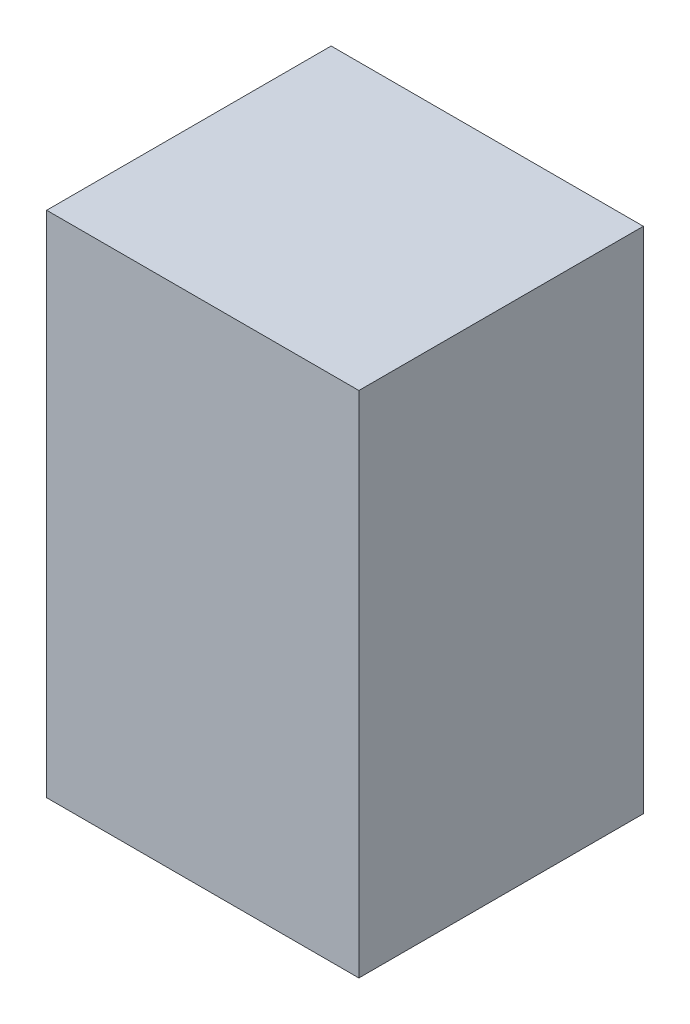
ISO-10303-21;
HEADER;
FILE_DESCRIPTION(('STEP AP214'),'2;1');
FILE_NAME('part.step','',(''),(''),'','','');
FILE_SCHEMA(('AUTOMOTIVE_DESIGN { 1 0 10303 214 1 1 1 1 }'));
ENDSEC;
DATA;
#1=APPLICATION_CONTEXT('core data for automotive mechanical design processes');
#2=APPLICATION_PROTOCOL_DEFINITION('international standard','automotive_design',2000,#1);
#3=PRODUCT_CONTEXT('',#1,'mechanical');
#4=PRODUCT('Part','Part','',(#3));
#5=PRODUCT_RELATED_PRODUCT_CATEGORY('part','',(#4));
#6=PRODUCT_DEFINITION_FORMATION('','',#4);
#7=PRODUCT_DEFINITION_CONTEXT('part definition',#1,'design');
#8=PRODUCT_DEFINITION('design','',#6,#7);
#9=PRODUCT_DEFINITION_SHAPE('','',#8);
#10=(LENGTH_UNIT() NAMED_UNIT(*) SI_UNIT(.MILLI.,.METRE.));
#11=(NAMED_UNIT(*) PLANE_ANGLE_UNIT() SI_UNIT($,.RADIAN.));
#12=(NAMED_UNIT(*) SI_UNIT($,.STERADIAN.) SOLID_ANGLE_UNIT());
#13=UNCERTAINTY_MEASURE_WITH_UNIT(LENGTH_MEASURE(1.E-05),#10,'distance_accuracy_value','');
#14=(GEOMETRIC_REPRESENTATION_CONTEXT(3) GLOBAL_UNCERTAINTY_ASSIGNED_CONTEXT((#13)) GLOBAL_UNIT_ASSIGNED_CONTEXT((#10,
#11,#12)) REPRESENTATION_CONTEXT('',''));
#15=CARTESIAN_POINT('',(0.,0.,0.));
#16=DIRECTION('',(0.,0.,1.));
#17=DIRECTION('',(1.,0.,0.));
#18=AXIS2_PLACEMENT_3D('',#15,#16,#17);
#19=CARTESIAN_POINT('',(135.,-220.,246.));
#20=DIRECTION('',(-1.,0.,0.));
#21=DIRECTION('',(0.,0.,1.));
#22=AXIS2_PLACEMENT_3D('',#19,#20,#21);
#23=PLANE('',#22);
#24=DIRECTION('',(0.,1.,0.));
#25=VECTOR('',#24,1.);
#26=CARTESIAN_POINT('',(135.,-220.,0.));
#27=LINE('',#26,#25);
#28=CARTESIAN_POINT('',(135.,-220.,0.));
#29=VERTEX_POINT('',#28);
#30=CARTESIAN_POINT('',(135.,220.,0.));
#31=VERTEX_POINT('',#30);
#32=EDGE_CURVE('E94',#29,#31,#27,.T.);
#33=ORIENTED_EDGE('',*,*,#32,.T.);
#34=DIRECTION('',(0.,0.,-1.));
#35=VECTOR('',#34,1.);
#36=CARTESIAN_POINT('',(135.,220.,246.));
#37=LINE('',#36,#35);
#38=CARTESIAN_POINT('',(135.,220.,246.));
#39=VERTEX_POINT('',#38);
#40=EDGE_CURVE('E11',#39,#31,#37,.T.);
#41=ORIENTED_EDGE('',*,*,#40,.F.);
#42=DIRECTION('',(0.,1.,0.));
#43=VECTOR('',#42,1.);
#44=CARTESIAN_POINT('',(135.,-220.,246.));
#45=LINE('',#44,#43);
#46=CARTESIAN_POINT('',(135.,-220.,246.));
#47=VERTEX_POINT('',#46);
#48=EDGE_CURVE('E82',#47,#39,#45,.T.);
#49=ORIENTED_EDGE('',*,*,#48,.F.);
#50=DIRECTION('',(0.,0.,-1.));
#51=VECTOR('',#50,1.);
#52=CARTESIAN_POINT('',(135.,-220.,246.));
#53=LINE('',#52,#51);
#54=EDGE_CURVE('E90',#47,#29,#53,.T.);
#55=ORIENTED_EDGE('',*,*,#54,.T.);
#56=EDGE_LOOP('',(#33,#41,#49,#55));
#57=FACE_BOUND('',#56,.T.);
#58=ADVANCED_FACE('F31',(#57),#23,.F.);
#59=CARTESIAN_POINT('',(-135.,220.,246.));
#60=DIRECTION('',(0.,-1.,0.));
#61=DIRECTION('',(0.,0.,-1.));
#62=AXIS2_PLACEMENT_3D('',#59,#60,#61);
#63=PLANE('',#62);
#64=DIRECTION('',(-1.,0.,0.));
#65=VECTOR('',#64,1.);
#66=CARTESIAN_POINT('',(-135.,220.,0.));
#67=LINE('',#66,#65);
#68=CARTESIAN_POINT('',(-135.,220.,0.));
#69=VERTEX_POINT('',#68);
#70=EDGE_CURVE('E86',#31,#69,#67,.T.);
#71=ORIENTED_EDGE('',*,*,#70,.T.);
#72=DIRECTION('',(0.,0.,-1.));
#73=VECTOR('',#72,1.);
#74=CARTESIAN_POINT('',(-135.,220.,246.));
#75=LINE('',#74,#73);
#76=CARTESIAN_POINT('',(-135.,220.,246.));
#77=VERTEX_POINT('',#76);
#78=EDGE_CURVE('E39',#77,#69,#75,.T.);
#79=ORIENTED_EDGE('',*,*,#78,.F.);
#80=DIRECTION('',(-1.,0.,0.));
#81=VECTOR('',#80,1.);
#82=CARTESIAN_POINT('',(-135.,220.,246.));
#83=LINE('',#82,#81);
#84=EDGE_CURVE('E77',#39,#77,#83,.T.);
#85=ORIENTED_EDGE('',*,*,#84,.F.);
#86=ORIENTED_EDGE('',*,*,#40,.T.);
#87=EDGE_LOOP('',(#71,#79,#85,#86));
#88=FACE_BOUND('',#87,.T.);
#89=ADVANCED_FACE('F85',(#88),#63,.F.);
#90=CARTESIAN_POINT('',(-135.,-220.,246.));
#91=DIRECTION('',(1.,0.,0.));
#92=DIRECTION('',(0.,0.,-1.));
#93=AXIS2_PLACEMENT_3D('',#90,#91,#92);
#94=PLANE('',#93);
#95=DIRECTION('',(0.,-1.,0.));
#96=VECTOR('',#95,1.);
#97=CARTESIAN_POINT('',(-135.,-220.,0.));
#98=LINE('',#97,#96);
#99=CARTESIAN_POINT('',(-135.,-220.,0.));
#100=VERTEX_POINT('',#99);
#101=EDGE_CURVE('E64',#69,#100,#98,.T.);
#102=ORIENTED_EDGE('',*,*,#101,.T.);
#103=DIRECTION('',(0.,0.,-1.));
#104=VECTOR('',#103,1.);
#105=CARTESIAN_POINT('',(-135.,-220.,246.));
#106=LINE('',#105,#104);
#107=CARTESIAN_POINT('',(-135.,-220.,246.));
#108=VERTEX_POINT('',#107);
#109=EDGE_CURVE('E87',#108,#100,#106,.T.);
#110=ORIENTED_EDGE('',*,*,#109,.F.);
#111=DIRECTION('',(0.,-1.,0.));
#112=VECTOR('',#111,1.);
#113=CARTESIAN_POINT('',(-135.,-220.,246.));
#114=LINE('',#113,#112);
#115=EDGE_CURVE('E80',#77,#108,#114,.T.);
#116=ORIENTED_EDGE('',*,*,#115,.F.);
#117=ORIENTED_EDGE('',*,*,#78,.T.);
#118=EDGE_LOOP('',(#102,#110,#116,#117));
#119=FACE_BOUND('',#118,.T.);
#120=ADVANCED_FACE('F88',(#119),#94,.F.);
#121=CARTESIAN_POINT('',(-135.,-220.,246.));
#122=DIRECTION('',(0.,1.,0.));
#123=DIRECTION('',(0.,0.,1.));
#124=AXIS2_PLACEMENT_3D('',#121,#122,#123);
#125=PLANE('',#124);
#126=DIRECTION('',(1.,0.,0.));
#127=VECTOR('',#126,1.);
#128=CARTESIAN_POINT('',(-135.,-220.,0.));
#129=LINE('',#128,#127);
#130=EDGE_CURVE('E70',#100,#29,#129,.T.);
#131=ORIENTED_EDGE('',*,*,#130,.T.);
#132=ORIENTED_EDGE('',*,*,#54,.F.);
#133=DIRECTION('',(1.,0.,0.));
#134=VECTOR('',#133,1.);
#135=CARTESIAN_POINT('',(-135.,-220.,246.));
#136=LINE('',#135,#134);
#137=EDGE_CURVE('E47',#108,#47,#136,.T.);
#138=ORIENTED_EDGE('',*,*,#137,.F.);
#139=ORIENTED_EDGE('',*,*,#109,.T.);
#140=EDGE_LOOP('',(#131,#132,#138,#139));
#141=FACE_BOUND('',#140,.T.);
#142=ADVANCED_FACE('F101',(#141),#125,.F.);
#143=CARTESIAN_POINT('',(135.,220.,246.));
#144=DIRECTION('',(0.,0.,-1.));
#145=DIRECTION('',(-1.,0.,0.));
#146=AXIS2_PLACEMENT_3D('',#143,#144,#145);
#147=PLANE('',#146);
#148=ORIENTED_EDGE('',*,*,#48,.T.);
#149=ORIENTED_EDGE('',*,*,#84,.T.);
#150=ORIENTED_EDGE('',*,*,#115,.T.);
#151=ORIENTED_EDGE('',*,*,#137,.T.);
#152=EDGE_LOOP('',(#148,#149,#150,#151));
#153=FACE_BOUND('',#152,.T.);
#154=ADVANCED_FACE('F78',(#153),#147,.F.);
#155=CARTESIAN_POINT('',(135.,220.,0.));
#156=DIRECTION('',(0.,0.,-1.));
#157=DIRECTION('',(-1.,0.,0.));
#158=AXIS2_PLACEMENT_3D('',#155,#156,#157);
#159=PLANE('',#158);
#160=ORIENTED_EDGE('',*,*,#32,.F.);
#161=ORIENTED_EDGE('',*,*,#130,.F.);
#162=ORIENTED_EDGE('',*,*,#101,.F.);
#163=ORIENTED_EDGE('',*,*,#70,.F.);
#164=EDGE_LOOP('',(#160,#161,#162,#163));
#165=FACE_BOUND('',#164,.T.);
#166=ADVANCED_FACE('F104',(#165),#159,.T.);
#167=CLOSED_SHELL('',(#58,#89,#120,#142,#154,#166));
#168=MANIFOLD_SOLID_BREP('B2',#167);
#169=ADVANCED_BREP_SHAPE_REPRESENTATION('',(#18,#168),#14);
#170=SHAPE_DEFINITION_REPRESENTATION(#9,#169);
ENDSEC;
END-ISO-10303-21;
